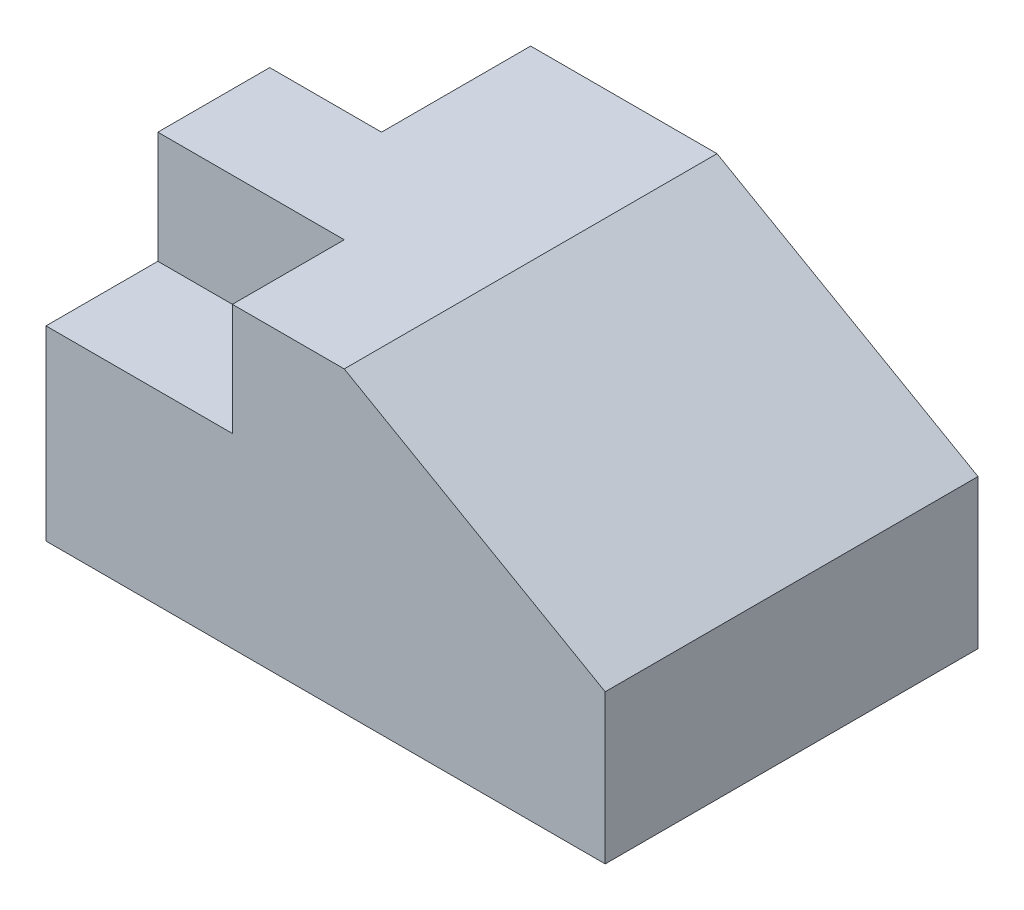
ISO-10303-21;
HEADER;
FILE_DESCRIPTION(('STEP AP214'),'2;1');
FILE_NAME('part.step','',(''),(''),'','','');
FILE_SCHEMA(('AUTOMOTIVE_DESIGN { 1 0 10303 214 1 1 1 1 }'));
ENDSEC;
DATA;
#1=APPLICATION_CONTEXT('core data for automotive mechanical design processes');
#2=APPLICATION_PROTOCOL_DEFINITION('international standard','automotive_design',2000,#1);
#3=PRODUCT_CONTEXT('',#1,'mechanical');
#4=PRODUCT('Part','Part','',(#3));
#5=PRODUCT_RELATED_PRODUCT_CATEGORY('part','',(#4));
#6=PRODUCT_DEFINITION_FORMATION('','',#4);
#7=PRODUCT_DEFINITION_CONTEXT('part definition',#1,'design');
#8=PRODUCT_DEFINITION('design','',#6,#7);
#9=PRODUCT_DEFINITION_SHAPE('','',#8);
#10=(LENGTH_UNIT() NAMED_UNIT(*) SI_UNIT(.MILLI.,.METRE.));
#11=(NAMED_UNIT(*) PLANE_ANGLE_UNIT() SI_UNIT($,.RADIAN.));
#12=(NAMED_UNIT(*) SI_UNIT($,.STERADIAN.) SOLID_ANGLE_UNIT());
#13=UNCERTAINTY_MEASURE_WITH_UNIT(LENGTH_MEASURE(1.E-05),#10,'distance_accuracy_value','');
#14=(GEOMETRIC_REPRESENTATION_CONTEXT(3) GLOBAL_UNCERTAINTY_ASSIGNED_CONTEXT((#13)) GLOBAL_UNIT_ASSIGNED_CONTEXT((#10,
#11,#12)) REPRESENTATION_CONTEXT('',''));
#15=CARTESIAN_POINT('',(0.,0.,0.));
#16=DIRECTION('',(0.,0.,1.));
#17=DIRECTION('',(1.,0.,0.));
#18=AXIS2_PLACEMENT_3D('',#15,#16,#17);
#19=CARTESIAN_POINT('',(-75.,0.,-100.));
#20=DIRECTION('',(1.,0.,0.));
#21=DIRECTION('',(0.,1.,0.));
#22=AXIS2_PLACEMENT_3D('',#19,#20,#21);
#23=PLANE('',#22);
#24=DIRECTION('',(0.,0.,1.));
#25=VECTOR('',#24,1.);
#26=CARTESIAN_POINT('',(-75.,40.,-100.));
#27=LINE('',#26,#25);
#28=CARTESIAN_POINT('',(-75.,40.,-60.));
#29=VERTEX_POINT('',#28);
#30=CARTESIAN_POINT('',(-75.,40.,-30.));
#31=VERTEX_POINT('',#30);
#32=EDGE_CURVE('E11',#29,#31,#27,.T.);
#33=ORIENTED_EDGE('',*,*,#32,.F.);
#34=DIRECTION('',(0.,1.,0.));
#35=VECTOR('',#34,1.);
#36=CARTESIAN_POINT('',(-75.,10.,-60.));
#37=LINE('',#36,#35);
#38=CARTESIAN_POINT('',(-75.,10.,-60.));
#39=VERTEX_POINT('',#38);
#40=EDGE_CURVE('E144',#39,#29,#37,.T.);
#41=ORIENTED_EDGE('',*,*,#40,.F.);
#42=DIRECTION('',(0.,0.,1.));
#43=VECTOR('',#42,1.);
#44=CARTESIAN_POINT('',(-75.,10.,-100.));
#45=LINE('',#44,#43);
#46=CARTESIAN_POINT('',(-75.,10.,-100.));
#47=VERTEX_POINT('',#46);
#48=EDGE_CURVE('E131',#47,#39,#45,.T.);
#49=ORIENTED_EDGE('',*,*,#48,.F.);
#50=DIRECTION('',(0.,1.,0.));
#51=VECTOR('',#50,1.);
#52=CARTESIAN_POINT('',(-75.,0.,-100.));
#53=LINE('',#52,#51);
#54=CARTESIAN_POINT('',(-75.,-40.,-100.));
#55=VERTEX_POINT('',#54);
#56=EDGE_CURVE('E143',#55,#47,#53,.T.);
#57=ORIENTED_EDGE('',*,*,#56,.F.);
#58=DIRECTION('',(0.,0.,1.));
#59=VECTOR('',#58,1.);
#60=CARTESIAN_POINT('',(-75.,-40.,-100.));
#61=LINE('',#60,#59);
#62=CARTESIAN_POINT('',(-75.,-40.,0.));
#63=VERTEX_POINT('',#62);
#64=EDGE_CURVE('E46',#55,#63,#61,.T.);
#65=ORIENTED_EDGE('',*,*,#64,.T.);
#66=DIRECTION('',(0.,1.,0.));
#67=VECTOR('',#66,1.);
#68=CARTESIAN_POINT('',(-75.,0.,0.));
#69=LINE('',#68,#67);
#70=CARTESIAN_POINT('',(-75.,10.,0.));
#71=VERTEX_POINT('',#70);
#72=EDGE_CURVE('E173',#63,#71,#69,.T.);
#73=ORIENTED_EDGE('',*,*,#72,.T.);
#74=DIRECTION('',(0.,0.,1.));
#75=VECTOR('',#74,1.);
#76=CARTESIAN_POINT('',(-75.,10.,-30.));
#77=LINE('',#76,#75);
#78=CARTESIAN_POINT('',(-75.,10.,-30.));
#79=VERTEX_POINT('',#78);
#80=EDGE_CURVE('E178',#79,#71,#77,.T.);
#81=ORIENTED_EDGE('',*,*,#80,.F.);
#82=DIRECTION('',(0.,1.,0.));
#83=VECTOR('',#82,1.);
#84=CARTESIAN_POINT('',(-75.,0.,-30.));
#85=LINE('',#84,#83);
#86=EDGE_CURVE('E217',#79,#31,#85,.T.);
#87=ORIENTED_EDGE('',*,*,#86,.T.);
#88=EDGE_LOOP('',(#33,#41,#49,#57,#65,#73,#81,#87));
#89=FACE_BOUND('',#88,.T.);
#90=ADVANCED_FACE('F43',(#89),#23,.F.);
#91=CARTESIAN_POINT('',(0.,40.,-100.));
#92=DIRECTION('',(0.,-1.,0.));
#93=DIRECTION('',(0.,0.,-1.));
#94=AXIS2_PLACEMENT_3D('',#91,#92,#93);
#95=PLANE('',#94);
#96=DIRECTION('',(1.,0.,0.));
#97=VECTOR('',#96,1.);
#98=CARTESIAN_POINT('',(0.,40.,-100.));
#99=LINE('',#98,#97);
#100=CARTESIAN_POINT('',(-45.,40.,-100.));
#101=VERTEX_POINT('',#100);
#102=CARTESIAN_POINT('',(4.99999999999998,40.,-100.));
#103=VERTEX_POINT('',#102);
#104=EDGE_CURVE('E170',#101,#103,#99,.T.);
#105=ORIENTED_EDGE('',*,*,#104,.F.);
#106=DIRECTION('',(0.,0.,-1.));
#107=VECTOR('',#106,1.);
#108=CARTESIAN_POINT('',(-45.,40.,-60.));
#109=LINE('',#108,#107);
#110=CARTESIAN_POINT('',(-45.,40.,-60.));
#111=VERTEX_POINT('',#110);
#112=EDGE_CURVE('E137',#111,#101,#109,.T.);
#113=ORIENTED_EDGE('',*,*,#112,.F.);
#114=DIRECTION('',(1.,0.,0.));
#115=VECTOR('',#114,1.);
#116=CARTESIAN_POINT('',(-75.,40.,-60.));
#117=LINE('',#116,#115);
#118=EDGE_CURVE('E246',#29,#111,#117,.T.);
#119=ORIENTED_EDGE('',*,*,#118,.F.);
#120=ORIENTED_EDGE('',*,*,#32,.T.);
#121=DIRECTION('',(1.,0.,0.));
#122=VECTOR('',#121,1.);
#123=CARTESIAN_POINT('',(0.,40.,-30.));
#124=LINE('',#123,#122);
#125=CARTESIAN_POINT('',(-25.,40.,-30.));
#126=VERTEX_POINT('',#125);
#127=EDGE_CURVE('E230',#31,#126,#124,.T.);
#128=ORIENTED_EDGE('',*,*,#127,.T.);
#129=DIRECTION('',(0.,0.,1.));
#130=VECTOR('',#129,1.);
#131=CARTESIAN_POINT('',(-25.,40.,-30.));
#132=LINE('',#131,#130);
#133=CARTESIAN_POINT('',(-25.,40.,0.));
#134=VERTEX_POINT('',#133);
#135=EDGE_CURVE('E221',#126,#134,#132,.T.);
#136=ORIENTED_EDGE('',*,*,#135,.T.);
#137=DIRECTION('',(1.,0.,0.));
#138=VECTOR('',#137,1.);
#139=CARTESIAN_POINT('',(0.,40.,0.));
#140=LINE('',#139,#138);
#141=CARTESIAN_POINT('',(4.99999999999998,40.,0.));
#142=VERTEX_POINT('',#141);
#143=EDGE_CURVE('E153',#134,#142,#140,.T.);
#144=ORIENTED_EDGE('',*,*,#143,.T.);
#145=DIRECTION('',(0.,0.,1.));
#146=VECTOR('',#145,1.);
#147=CARTESIAN_POINT('',(4.99999999999998,40.,-100.));
#148=LINE('',#147,#146);
#149=EDGE_CURVE('E52',#103,#142,#148,.T.);
#150=ORIENTED_EDGE('',*,*,#149,.F.);
#151=EDGE_LOOP('',(#105,#113,#119,#120,#128,#136,#144,#150));
#152=FACE_BOUND('',#151,.T.);
#153=ADVANCED_FACE('F259',(#152),#95,.F.);
#154=CARTESIAN_POINT('',(0.,0.,0.));
#155=DIRECTION('',(0.,0.,1.));
#156=DIRECTION('',(1.,0.,0.));
#157=AXIS2_PLACEMENT_3D('',#154,#155,#156);
#158=PLANE('',#157);
#159=DIRECTION('',(0.,-1.,0.));
#160=VECTOR('',#159,1.);
#161=CARTESIAN_POINT('',(-25.,0.,0.));
#162=LINE('',#161,#160);
#163=CARTESIAN_POINT('',(-25.,10.,0.));
#164=VERTEX_POINT('',#163);
#165=EDGE_CURVE('E206',#134,#164,#162,.T.);
#166=ORIENTED_EDGE('',*,*,#165,.T.);
#167=DIRECTION('',(-1.,0.,0.));
#168=VECTOR('',#167,1.);
#169=CARTESIAN_POINT('',(0.,10.,0.));
#170=LINE('',#169,#168);
#171=EDGE_CURVE('E68',#164,#71,#170,.T.);
#172=ORIENTED_EDGE('',*,*,#171,.T.);
#173=ORIENTED_EDGE('',*,*,#72,.F.);
#174=DIRECTION('',(-1.,0.,0.));
#175=VECTOR('',#174,1.);
#176=CARTESIAN_POINT('',(0.,-40.,0.));
#177=LINE('',#176,#175);
#178=CARTESIAN_POINT('',(75.,-40.,0.));
#179=VERTEX_POINT('',#178);
#180=EDGE_CURVE('E177',#179,#63,#177,.T.);
#181=ORIENTED_EDGE('',*,*,#180,.F.);
#182=DIRECTION('',(0.,-1.,0.));
#183=VECTOR('',#182,1.);
#184=CARTESIAN_POINT('',(75.,0.,0.));
#185=LINE('',#184,#183);
#186=CARTESIAN_POINT('',(75.,0.,0.));
#187=VERTEX_POINT('',#186);
#188=EDGE_CURVE('E181',#187,#179,#185,.T.);
#189=ORIENTED_EDGE('',*,*,#188,.F.);
#190=DIRECTION('',(0.868243142124459,-0.496138938356834,0.));
#191=VECTOR('',#190,1.);
#192=CARTESIAN_POINT('',(18.4615384615385,32.3076923076923,0.));
#193=LINE('',#192,#191);
#194=EDGE_CURVE('E159',#142,#187,#193,.T.);
#195=ORIENTED_EDGE('',*,*,#194,.F.);
#196=ORIENTED_EDGE('',*,*,#143,.F.);
#197=EDGE_LOOP('',(#166,#172,#173,#181,#189,#195,#196));
#198=FACE_BOUND('',#197,.T.);
#199=ADVANCED_FACE('F203',(#198),#158,.T.);
#200=CARTESIAN_POINT('',(18.4615384615385,32.3076923076923,-100.));
#201=DIRECTION('',(-0.496138938356834,-0.868243142124459,0.));
#202=DIRECTION('',(0.868243142124459,-0.496138938356834,0.));
#203=AXIS2_PLACEMENT_3D('',#200,#201,#202);
#204=PLANE('',#203);
#205=ORIENTED_EDGE('',*,*,#194,.T.);
#206=DIRECTION('',(0.,0.,1.));
#207=VECTOR('',#206,1.);
#208=CARTESIAN_POINT('',(75.,0.,-100.));
#209=LINE('',#208,#207);
#210=CARTESIAN_POINT('',(75.,0.,-100.));
#211=VERTEX_POINT('',#210);
#212=EDGE_CURVE('E189',#211,#187,#209,.T.);
#213=ORIENTED_EDGE('',*,*,#212,.F.);
#214=DIRECTION('',(0.868243142124459,-0.496138938356834,0.));
#215=VECTOR('',#214,1.);
#216=CARTESIAN_POINT('',(18.4615384615385,32.3076923076923,-100.));
#217=LINE('',#216,#215);
#218=EDGE_CURVE('E167',#103,#211,#217,.T.);
#219=ORIENTED_EDGE('',*,*,#218,.F.);
#220=ORIENTED_EDGE('',*,*,#149,.T.);
#221=EDGE_LOOP('',(#205,#213,#219,#220));
#222=FACE_BOUND('',#221,.T.);
#223=ADVANCED_FACE('F265',(#222),#204,.F.);
#224=CARTESIAN_POINT('',(75.,0.,-100.));
#225=DIRECTION('',(-1.,0.,0.));
#226=DIRECTION('',(0.,-1.,0.));
#227=AXIS2_PLACEMENT_3D('',#224,#225,#226);
#228=PLANE('',#227);
#229=ORIENTED_EDGE('',*,*,#188,.T.);
#230=DIRECTION('',(0.,0.,1.));
#231=VECTOR('',#230,1.);
#232=CARTESIAN_POINT('',(75.,-40.,-100.));
#233=LINE('',#232,#231);
#234=CARTESIAN_POINT('',(75.,-40.,-100.));
#235=VERTEX_POINT('',#234);
#236=EDGE_CURVE('E192',#235,#179,#233,.T.);
#237=ORIENTED_EDGE('',*,*,#236,.F.);
#238=DIRECTION('',(0.,-1.,0.));
#239=VECTOR('',#238,1.);
#240=CARTESIAN_POINT('',(75.,0.,-100.));
#241=LINE('',#240,#239);
#242=EDGE_CURVE('E157',#211,#235,#241,.T.);
#243=ORIENTED_EDGE('',*,*,#242,.F.);
#244=ORIENTED_EDGE('',*,*,#212,.T.);
#245=EDGE_LOOP('',(#229,#237,#243,#244));
#246=FACE_BOUND('',#245,.T.);
#247=ADVANCED_FACE('F268',(#246),#228,.F.);
#248=CARTESIAN_POINT('',(0.,-40.,-100.));
#249=DIRECTION('',(0.,1.,0.));
#250=DIRECTION('',(-1.,0.,0.));
#251=AXIS2_PLACEMENT_3D('',#248,#249,#250);
#252=PLANE('',#251);
#253=ORIENTED_EDGE('',*,*,#180,.T.);
#254=ORIENTED_EDGE('',*,*,#64,.F.);
#255=DIRECTION('',(-1.,0.,0.));
#256=VECTOR('',#255,1.);
#257=CARTESIAN_POINT('',(0.,-40.,-100.));
#258=LINE('',#257,#256);
#259=EDGE_CURVE('E150',#235,#55,#258,.T.);
#260=ORIENTED_EDGE('',*,*,#259,.F.);
#261=ORIENTED_EDGE('',*,*,#236,.T.);
#262=EDGE_LOOP('',(#253,#254,#260,#261));
#263=FACE_BOUND('',#262,.T.);
#264=ADVANCED_FACE('F269',(#263),#252,.F.);
#265=CARTESIAN_POINT('',(0.,0.,-100.));
#266=DIRECTION('',(0.,0.,1.));
#267=DIRECTION('',(1.,0.,0.));
#268=AXIS2_PLACEMENT_3D('',#265,#266,#267);
#269=PLANE('',#268);
#270=DIRECTION('',(-1.,0.,0.));
#271=VECTOR('',#270,1.);
#272=CARTESIAN_POINT('',(-45.,10.,-100.));
#273=LINE('',#272,#271);
#274=CARTESIAN_POINT('',(-45.,10.,-100.));
#275=VERTEX_POINT('',#274);
#276=EDGE_CURVE('E128',#275,#47,#273,.T.);
#277=ORIENTED_EDGE('',*,*,#276,.F.);
#278=DIRECTION('',(0.,1.,0.));
#279=VECTOR('',#278,1.);
#280=CARTESIAN_POINT('',(-45.,10.,-100.));
#281=LINE('',#280,#279);
#282=EDGE_CURVE('E208',#275,#101,#281,.T.);
#283=ORIENTED_EDGE('',*,*,#282,.T.);
#284=ORIENTED_EDGE('',*,*,#104,.T.);
#285=ORIENTED_EDGE('',*,*,#218,.T.);
#286=ORIENTED_EDGE('',*,*,#242,.T.);
#287=ORIENTED_EDGE('',*,*,#259,.T.);
#288=ORIENTED_EDGE('',*,*,#56,.T.);
#289=EDGE_LOOP('',(#277,#283,#284,#285,#286,#287,#288));
#290=FACE_BOUND('',#289,.T.);
#291=ADVANCED_FACE('F148',(#290),#269,.F.);
#292=CARTESIAN_POINT('',(0.,10.,-30.));
#293=DIRECTION('',(0.,1.,0.));
#294=DIRECTION('',(-1.,0.,0.));
#295=AXIS2_PLACEMENT_3D('',#292,#293,#294);
#296=PLANE('',#295);
#297=ORIENTED_EDGE('',*,*,#171,.F.);
#298=DIRECTION('',(0.,0.,1.));
#299=VECTOR('',#298,1.);
#300=CARTESIAN_POINT('',(-25.,10.,-30.));
#301=LINE('',#300,#299);
#302=CARTESIAN_POINT('',(-25.,10.,-30.));
#303=VERTEX_POINT('',#302);
#304=EDGE_CURVE('E162',#303,#164,#301,.T.);
#305=ORIENTED_EDGE('',*,*,#304,.F.);
#306=DIRECTION('',(-1.,0.,0.));
#307=VECTOR('',#306,1.);
#308=CARTESIAN_POINT('',(0.,10.,-30.));
#309=LINE('',#308,#307);
#310=EDGE_CURVE('E212',#303,#79,#309,.T.);
#311=ORIENTED_EDGE('',*,*,#310,.T.);
#312=ORIENTED_EDGE('',*,*,#80,.T.);
#313=EDGE_LOOP('',(#297,#305,#311,#312));
#314=FACE_BOUND('',#313,.T.);
#315=ADVANCED_FACE('F275',(#314),#296,.T.);
#316=CARTESIAN_POINT('',(-25.,0.,-30.));
#317=DIRECTION('',(-1.,0.,0.));
#318=DIRECTION('',(0.,-1.,0.));
#319=AXIS2_PLACEMENT_3D('',#316,#317,#318);
#320=PLANE('',#319);
#321=ORIENTED_EDGE('',*,*,#165,.F.);
#322=ORIENTED_EDGE('',*,*,#135,.F.);
#323=DIRECTION('',(0.,-1.,0.));
#324=VECTOR('',#323,1.);
#325=CARTESIAN_POINT('',(-25.,0.,-30.));
#326=LINE('',#325,#324);
#327=EDGE_CURVE('E232',#126,#303,#326,.T.);
#328=ORIENTED_EDGE('',*,*,#327,.T.);
#329=ORIENTED_EDGE('',*,*,#304,.T.);
#330=EDGE_LOOP('',(#321,#322,#328,#329));
#331=FACE_BOUND('',#330,.T.);
#332=ADVANCED_FACE('F319',(#331),#320,.T.);
#333=CARTESIAN_POINT('',(0.,0.,-30.));
#334=DIRECTION('',(0.,0.,1.));
#335=DIRECTION('',(1.,0.,0.));
#336=AXIS2_PLACEMENT_3D('',#333,#334,#335);
#337=PLANE('',#336);
#338=ORIENTED_EDGE('',*,*,#310,.F.);
#339=ORIENTED_EDGE('',*,*,#327,.F.);
#340=ORIENTED_EDGE('',*,*,#127,.F.);
#341=ORIENTED_EDGE('',*,*,#86,.F.);
#342=EDGE_LOOP('',(#338,#339,#340,#341));
#343=FACE_BOUND('',#342,.T.);
#344=ADVANCED_FACE('F330',(#343),#337,.T.);
#345=CARTESIAN_POINT('',(-45.,10.,-60.));
#346=DIRECTION('',(1.,0.,0.));
#347=DIRECTION('',(0.,0.,-1.));
#348=AXIS2_PLACEMENT_3D('',#345,#346,#347);
#349=PLANE('',#348);
#350=ORIENTED_EDGE('',*,*,#112,.T.);
#351=ORIENTED_EDGE('',*,*,#282,.F.);
#352=DIRECTION('',(0.,0.,-1.));
#353=VECTOR('',#352,1.);
#354=CARTESIAN_POINT('',(-45.,10.,-60.));
#355=LINE('',#354,#353);
#356=CARTESIAN_POINT('',(-45.,10.,-60.));
#357=VERTEX_POINT('',#356);
#358=EDGE_CURVE('E60',#357,#275,#355,.T.);
#359=ORIENTED_EDGE('',*,*,#358,.F.);
#360=DIRECTION('',(0.,1.,0.));
#361=VECTOR('',#360,1.);
#362=CARTESIAN_POINT('',(-45.,10.,-60.));
#363=LINE('',#362,#361);
#364=EDGE_CURVE('E214',#357,#111,#363,.T.);
#365=ORIENTED_EDGE('',*,*,#364,.T.);
#366=EDGE_LOOP('',(#350,#351,#359,#365));
#367=FACE_BOUND('',#366,.T.);
#368=ADVANCED_FACE('F255',(#367),#349,.F.);
#369=CARTESIAN_POINT('',(-75.,10.,-60.));
#370=DIRECTION('',(0.,0.,1.));
#371=DIRECTION('',(1.,0.,0.));
#372=AXIS2_PLACEMENT_3D('',#369,#370,#371);
#373=PLANE('',#372);
#374=ORIENTED_EDGE('',*,*,#118,.T.);
#375=ORIENTED_EDGE('',*,*,#364,.F.);
#376=DIRECTION('',(1.,0.,0.));
#377=VECTOR('',#376,1.);
#378=CARTESIAN_POINT('',(-75.,10.,-60.));
#379=LINE('',#378,#377);
#380=EDGE_CURVE('E146',#39,#357,#379,.T.);
#381=ORIENTED_EDGE('',*,*,#380,.F.);
#382=ORIENTED_EDGE('',*,*,#40,.T.);
#383=EDGE_LOOP('',(#374,#375,#381,#382));
#384=FACE_BOUND('',#383,.T.);
#385=ADVANCED_FACE('F363',(#384),#373,.F.);
#386=CARTESIAN_POINT('',(0.,10.,0.));
#387=DIRECTION('',(0.,1.,0.));
#388=DIRECTION('',(0.,0.,1.));
#389=AXIS2_PLACEMENT_3D('',#386,#387,#388);
#390=PLANE('',#389);
#391=ORIENTED_EDGE('',*,*,#276,.T.);
#392=ORIENTED_EDGE('',*,*,#48,.T.);
#393=ORIENTED_EDGE('',*,*,#380,.T.);
#394=ORIENTED_EDGE('',*,*,#358,.T.);
#395=EDGE_LOOP('',(#391,#392,#393,#394));
#396=FACE_BOUND('',#395,.T.);
#397=ADVANCED_FACE('F130',(#396),#390,.T.);
#398=CLOSED_SHELL('',(#90,#153,#199,#223,#247,#264,#291,#315,#332,#344,#368,#385,#397));
#399=MANIFOLD_SOLID_BREP('B2',#398);
#400=ADVANCED_BREP_SHAPE_REPRESENTATION('',(#18,#399),#14);
#401=SHAPE_DEFINITION_REPRESENTATION(#9,#400);
ENDSEC;
END-ISO-10303-21;
